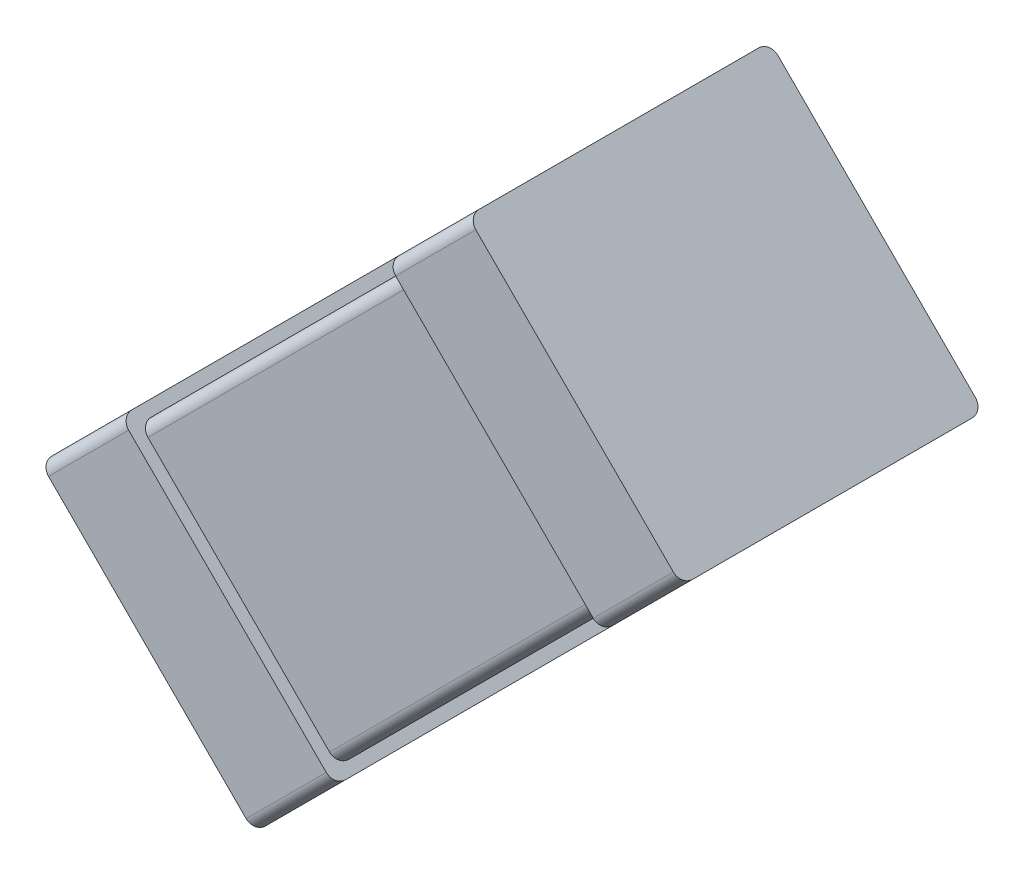
ISO-10303-21;
HEADER;
FILE_DESCRIPTION(('STEP AP214'),'2;1');
FILE_NAME('part.step','',(''),(''),'','','');
FILE_SCHEMA(('AUTOMOTIVE_DESIGN { 1 0 10303 214 1 1 1 1 }'));
ENDSEC;
DATA;
#1=APPLICATION_CONTEXT('core data for automotive mechanical design processes');
#2=APPLICATION_PROTOCOL_DEFINITION('international standard','automotive_design',2000,#1);
#3=PRODUCT_CONTEXT('',#1,'mechanical');
#4=PRODUCT('Part','Part','',(#3));
#5=PRODUCT_RELATED_PRODUCT_CATEGORY('part','',(#4));
#6=PRODUCT_DEFINITION_FORMATION('','',#4);
#7=PRODUCT_DEFINITION_CONTEXT('part definition',#1,'design');
#8=PRODUCT_DEFINITION('design','',#6,#7);
#9=PRODUCT_DEFINITION_SHAPE('','',#8);
#10=(LENGTH_UNIT() NAMED_UNIT(*) SI_UNIT(.MILLI.,.METRE.));
#11=(NAMED_UNIT(*) PLANE_ANGLE_UNIT() SI_UNIT($,.RADIAN.));
#12=(NAMED_UNIT(*) SI_UNIT($,.STERADIAN.) SOLID_ANGLE_UNIT());
#13=UNCERTAINTY_MEASURE_WITH_UNIT(LENGTH_MEASURE(1.E-05),#10,'distance_accuracy_value','');
#14=(GEOMETRIC_REPRESENTATION_CONTEXT(3) GLOBAL_UNCERTAINTY_ASSIGNED_CONTEXT((#13)) GLOBAL_UNIT_ASSIGNED_CONTEXT((#10,
#11,#12)) REPRESENTATION_CONTEXT('',''));
#15=CARTESIAN_POINT('',(0.,0.,0.));
#16=DIRECTION('',(0.,0.,1.));
#17=DIRECTION('',(1.,0.,0.));
#18=AXIS2_PLACEMENT_3D('',#15,#16,#17);
#19=CARTESIAN_POINT('',(165.881216142514,96.0422005798756,112.211582908599));
#20=DIRECTION('',(-0.707106781186547,-0.707106781186548,0.));
#21=DIRECTION('',(-0.707106781186548,0.707106781186547,0.));
#22=AXIS2_PLACEMENT_3D('',#19,#20,#21);
#23=PLANE('',#22);
#24=DIRECTION('',(0.,0.,1.));
#25=VECTOR('',#24,1.);
#26=CARTESIAN_POINT('',(165.881216142514,96.0422005798756,112.211582908599));
#27=LINE('',#26,#25);
#28=CARTESIAN_POINT('',(165.881216142514,96.0422005798756,112.241582908599));
#29=VERTEX_POINT('',#28);
#30=CARTESIAN_POINT('',(165.881216142514,96.0422005798756,112.981582908599));
#31=VERTEX_POINT('',#30);
#32=EDGE_CURVE('E67',#29,#31,#27,.T.);
#33=ORIENTED_EDGE('',*,*,#32,.F.);
#34=CARTESIAN_POINT('',(165.902429345949,96.02098737644,112.241582908599));
#35=DIRECTION('',(-0.707106781186547,-0.707106781186548,0.));
#36=DIRECTION('',(0.,0.,1.));
#37=AXIS2_PLACEMENT_3D('',#34,#35,#36);
#38=CIRCLE('',#37,0.0300000000000023);
#39=CARTESIAN_POINT('',(165.902429345949,96.02098737644,112.211582908599));
#40=VERTEX_POINT('',#39);
#41=EDGE_CURVE('E11',#29,#40,#38,.T.);
#42=ORIENTED_EDGE('',*,*,#41,.T.);
#43=DIRECTION('',(0.707106781186548,-0.707106781186547,0.));
#44=VECTOR('',#43,1.);
#45=CARTESIAN_POINT('',(165.881216142514,96.0422005798756,112.211582908599));
#46=LINE('',#45,#44);
#47=CARTESIAN_POINT('',(166.425688364028,95.4977283583619,112.211582908599));
#48=VERTEX_POINT('',#47);
#49=EDGE_CURVE('E55',#40,#48,#46,.T.);
#50=ORIENTED_EDGE('',*,*,#49,.T.);
#51=CARTESIAN_POINT('',(166.425688364028,95.4977283583619,112.241582908599));
#52=DIRECTION('',(0.707106781186547,0.707106781186548,0.));
#53=DIRECTION('',(0.,0.,1.));
#54=AXIS2_PLACEMENT_3D('',#51,#52,#53);
#55=CIRCLE('',#54,0.0300000000000023);
#56=CARTESIAN_POINT('',(166.446901567463,95.4765151549263,112.241582908599));
#57=VERTEX_POINT('',#56);
#58=EDGE_CURVE('E393',#57,#48,#55,.T.);
#59=ORIENTED_EDGE('',*,*,#58,.F.);
#60=DIRECTION('',(0.,0.,1.));
#61=VECTOR('',#60,1.);
#62=CARTESIAN_POINT('',(166.446901567463,95.4765151549263,112.211582908599));
#63=LINE('',#62,#61);
#64=CARTESIAN_POINT('',(166.446901567463,95.4765151549263,112.981582908599));
#65=VERTEX_POINT('',#64);
#66=EDGE_CURVE('E379',#57,#65,#63,.T.);
#67=ORIENTED_EDGE('',*,*,#66,.T.);
#68=CARTESIAN_POINT('',(166.425688364028,95.4977283583619,112.981582908599));
#69=DIRECTION('',(-0.707106781186547,-0.707106781186548,0.));
#70=DIRECTION('',(0.,0.,1.));
#71=AXIS2_PLACEMENT_3D('',#68,#69,#70);
#72=CIRCLE('',#71,0.0300000000000023);
#73=CARTESIAN_POINT('',(166.425688364028,95.4977283583619,113.011582908599));
#74=VERTEX_POINT('',#73);
#75=EDGE_CURVE('E48',#65,#74,#72,.T.);
#76=ORIENTED_EDGE('',*,*,#75,.T.);
#77=DIRECTION('',(0.707106781186548,-0.707106781186547,0.));
#78=VECTOR('',#77,1.);
#79=CARTESIAN_POINT('',(165.881216142514,96.0422005798756,113.011582908599));
#80=LINE('',#79,#78);
#81=CARTESIAN_POINT('',(165.902429345949,96.02098737644,113.011582908599));
#82=VERTEX_POINT('',#81);
#83=EDGE_CURVE('E431',#82,#74,#80,.T.);
#84=ORIENTED_EDGE('',*,*,#83,.F.);
#85=CARTESIAN_POINT('',(165.902429345949,96.02098737644,112.981582908599));
#86=DIRECTION('',(0.707106781186547,0.707106781186548,0.));
#87=DIRECTION('',(0.,0.,1.));
#88=AXIS2_PLACEMENT_3D('',#85,#86,#87);
#89=CIRCLE('',#88,0.0300000000000023);
#90=EDGE_CURVE('E474',#31,#82,#89,.T.);
#91=ORIENTED_EDGE('',*,*,#90,.F.);
#92=EDGE_LOOP('',(#33,#42,#50,#59,#67,#76,#84,#91));
#93=FACE_BOUND('',#92,.T.);
#94=ADVANCED_FACE('F44',(#93),#23,.T.);
#95=CARTESIAN_POINT('',(166.659033601819,95.6886471892823,112.211582908599));
#96=DIRECTION('',(0.707106781186548,-0.707106781186547,0.));
#97=DIRECTION('',(0.,0.,-1.));
#98=AXIS2_PLACEMENT_3D('',#95,#96,#97);
#99=PLANE('',#98);
#100=ORIENTED_EDGE('',*,*,#66,.F.);
#101=DIRECTION('',(-0.707106781186547,-0.707106781186548,0.));
#102=VECTOR('',#101,1.);
#103=CARTESIAN_POINT('',(166.659033601819,95.6886471892823,112.241582908599));
#104=LINE('',#103,#102);
#105=CARTESIAN_POINT('',(166.659033601819,95.6886471892823,112.241582908599));
#106=VERTEX_POINT('',#105);
#107=EDGE_CURVE('E397',#106,#57,#104,.T.);
#108=ORIENTED_EDGE('',*,*,#107,.F.);
#109=DIRECTION('',(0.,0.,1.));
#110=VECTOR('',#109,1.);
#111=CARTESIAN_POINT('',(166.659033601819,95.6886471892823,112.211582908599));
#112=LINE('',#111,#110);
#113=CARTESIAN_POINT('',(166.659033601819,95.6886471892823,112.981582908599));
#114=VERTEX_POINT('',#113);
#115=EDGE_CURVE('E468',#106,#114,#112,.T.);
#116=ORIENTED_EDGE('',*,*,#115,.T.);
#117=DIRECTION('',(-0.707106781186547,-0.707106781186548,0.));
#118=VECTOR('',#117,1.);
#119=CARTESIAN_POINT('',(166.659033601819,95.6886471892823,112.981582908599));
#120=LINE('',#119,#118);
#121=EDGE_CURVE('E452',#114,#65,#120,.T.);
#122=ORIENTED_EDGE('',*,*,#121,.T.);
#123=EDGE_LOOP('',(#100,#108,#116,#122));
#124=FACE_BOUND('',#123,.T.);
#125=ADVANCED_FACE('F608',(#124),#99,.T.);
#126=CARTESIAN_POINT('',(166.637820398384,95.7098603927179,112.981582908599));
#127=DIRECTION('',(-0.707106781186548,-0.707106781186548,0.));
#128=DIRECTION('',(0.707106781186548,-0.707106781186548,0.));
#129=AXIS2_PLACEMENT_3D('',#126,#127,#128);
#130=CYLINDRICAL_SURFACE('',#129,0.0299999999999963);
#131=CARTESIAN_POINT('',(166.637820398384,95.7098603927179,112.981582908599));
#132=DIRECTION('',(-0.707106781186547,-0.707106781186548,0.));
#133=DIRECTION('',(0.,0.,1.));
#134=AXIS2_PLACEMENT_3D('',#131,#132,#133);
#135=CIRCLE('',#134,0.0300000000000023);
#136=CARTESIAN_POINT('',(166.637820398384,95.7098603927179,113.011582908599));
#137=VERTEX_POINT('',#136);
#138=EDGE_CURVE('E448',#114,#137,#135,.T.);
#139=ORIENTED_EDGE('',*,*,#138,.T.);
#140=DIRECTION('',(-0.707106781186547,-0.707106781186548,0.));
#141=VECTOR('',#140,1.);
#142=CARTESIAN_POINT('',(166.637820398384,95.7098603927179,113.011582908599));
#143=LINE('',#142,#141);
#144=EDGE_CURVE('E453',#137,#74,#143,.T.);
#145=ORIENTED_EDGE('',*,*,#144,.T.);
#146=ORIENTED_EDGE('',*,*,#75,.F.);
#147=ORIENTED_EDGE('',*,*,#121,.F.);
#148=EDGE_LOOP('',(#139,#145,#146,#147));
#149=FACE_BOUND('',#148,.T.);
#150=ADVANCED_FACE('F613',(#149),#130,.T.);
#151=CARTESIAN_POINT('',(166.637820398384,95.7098603927179,112.241582908599));
#152=DIRECTION('',(-0.707106781186548,-0.707106781186548,0.));
#153=DIRECTION('',(0.707106781186548,-0.707106781186548,0.));
#154=AXIS2_PLACEMENT_3D('',#151,#152,#153);
#155=CYLINDRICAL_SURFACE('',#154,0.0299999999999963);
#156=ORIENTED_EDGE('',*,*,#107,.T.);
#157=ORIENTED_EDGE('',*,*,#58,.T.);
#158=DIRECTION('',(-0.707106781186547,-0.707106781186548,0.));
#159=VECTOR('',#158,1.);
#160=CARTESIAN_POINT('',(166.637820398384,95.7098603927179,112.211582908599));
#161=LINE('',#160,#159);
#162=CARTESIAN_POINT('',(166.637820398384,95.7098603927179,112.211582908599));
#163=VERTEX_POINT('',#162);
#164=EDGE_CURVE('E496',#163,#48,#161,.T.);
#165=ORIENTED_EDGE('',*,*,#164,.F.);
#166=CARTESIAN_POINT('',(166.637820398384,95.7098603927179,112.241582908599));
#167=DIRECTION('',(0.707106781186547,0.707106781186548,0.));
#168=DIRECTION('',(0.,0.,1.));
#169=AXIS2_PLACEMENT_3D('',#166,#167,#168);
#170=CIRCLE('',#169,0.0300000000000023);
#171=EDGE_CURVE('E320',#106,#163,#170,.T.);
#172=ORIENTED_EDGE('',*,*,#171,.F.);
#173=EDGE_LOOP('',(#156,#157,#165,#172));
#174=FACE_BOUND('',#173,.T.);
#175=ADVANCED_FACE('F627',(#174),#155,.T.);
#176=CARTESIAN_POINT('',(166.09334817687,96.2543326142315,113.011582908599));
#177=DIRECTION('',(0.,0.,1.));
#178=DIRECTION('',(1.,0.,0.));
#179=AXIS2_PLACEMENT_3D('',#176,#177,#178);
#180=PLANE('',#179);
#181=DIRECTION('',(0.707106781186548,-0.707106781186547,0.));
#182=VECTOR('',#181,1.);
#183=CARTESIAN_POINT('',(166.09334817687,96.2543326142315,113.011582908599));
#184=LINE('',#183,#182);
#185=CARTESIAN_POINT('',(166.114561380306,96.2331194107959,113.011582908599));
#186=VERTEX_POINT('',#185);
#187=EDGE_CURVE('E315',#186,#137,#184,.T.);
#188=ORIENTED_EDGE('',*,*,#187,.F.);
#189=DIRECTION('',(-0.707106781186547,-0.707106781186548,0.));
#190=VECTOR('',#189,1.);
#191=CARTESIAN_POINT('',(166.114561380306,96.2331194107959,113.011582908599));
#192=LINE('',#191,#190);
#193=EDGE_CURVE('E398',#186,#82,#192,.T.);
#194=ORIENTED_EDGE('',*,*,#193,.T.);
#195=ORIENTED_EDGE('',*,*,#83,.T.);
#196=ORIENTED_EDGE('',*,*,#144,.F.);
#197=EDGE_LOOP('',(#188,#194,#195,#196));
#198=FACE_BOUND('',#197,.T.);
#199=ADVANCED_FACE('F620',(#198),#180,.T.);
#200=CARTESIAN_POINT('',(166.09334817687,96.2543326142315,112.211582908599));
#201=DIRECTION('',(0.,0.,1.));
#202=DIRECTION('',(1.,0.,0.));
#203=AXIS2_PLACEMENT_3D('',#200,#201,#202);
#204=PLANE('',#203);
#205=ORIENTED_EDGE('',*,*,#164,.T.);
#206=ORIENTED_EDGE('',*,*,#49,.F.);
#207=DIRECTION('',(-0.707106781186547,-0.707106781186548,0.));
#208=VECTOR('',#207,1.);
#209=CARTESIAN_POINT('',(166.114561380306,96.2331194107959,112.211582908599));
#210=LINE('',#209,#208);
#211=CARTESIAN_POINT('',(166.114561380306,96.2331194107959,112.211582908599));
#212=VERTEX_POINT('',#211);
#213=EDGE_CURVE('E419',#212,#40,#210,.T.);
#214=ORIENTED_EDGE('',*,*,#213,.F.);
#215=DIRECTION('',(0.707106781186548,-0.707106781186547,0.));
#216=VECTOR('',#215,1.);
#217=CARTESIAN_POINT('',(166.09334817687,96.2543326142315,112.211582908599));
#218=LINE('',#217,#216);
#219=EDGE_CURVE('E544',#212,#163,#218,.T.);
#220=ORIENTED_EDGE('',*,*,#219,.T.);
#221=EDGE_LOOP('',(#205,#206,#214,#220));
#222=FACE_BOUND('',#221,.T.);
#223=ADVANCED_FACE('F617',(#222),#204,.F.);
#224=CARTESIAN_POINT('',(166.114561380306,96.2331194107959,112.981582908599));
#225=DIRECTION('',(-0.707106781186548,-0.707106781186548,0.));
#226=DIRECTION('',(-0.707106781186548,0.707106781186548,0.));
#227=AXIS2_PLACEMENT_3D('',#224,#225,#226);
#228=CYLINDRICAL_SURFACE('',#227,0.0299999999999963);
#229=DIRECTION('',(-0.707106781186547,-0.707106781186548,0.));
#230=VECTOR('',#229,1.);
#231=CARTESIAN_POINT('',(166.09334817687,96.2543326142315,112.981582908599));
#232=LINE('',#231,#230);
#233=CARTESIAN_POINT('',(166.09334817687,96.2543326142315,112.981582908599));
#234=VERTEX_POINT('',#233);
#235=EDGE_CURVE('E309',#234,#31,#232,.T.);
#236=ORIENTED_EDGE('',*,*,#235,.T.);
#237=ORIENTED_EDGE('',*,*,#90,.T.);
#238=ORIENTED_EDGE('',*,*,#193,.F.);
#239=CARTESIAN_POINT('',(166.114561380306,96.2331194107959,112.981582908599));
#240=DIRECTION('',(0.707106781186547,0.707106781186548,0.));
#241=DIRECTION('',(0.,0.,1.));
#242=AXIS2_PLACEMENT_3D('',#239,#240,#241);
#243=CIRCLE('',#242,0.0300000000000023);
#244=EDGE_CURVE('E319',#234,#186,#243,.T.);
#245=ORIENTED_EDGE('',*,*,#244,.F.);
#246=EDGE_LOOP('',(#236,#237,#238,#245));
#247=FACE_BOUND('',#246,.T.);
#248=ADVANCED_FACE('F557',(#247),#228,.T.);
#249=CARTESIAN_POINT('',(166.114561380306,96.2331194107959,112.241582908599));
#250=DIRECTION('',(-0.707106781186548,-0.707106781186548,0.));
#251=DIRECTION('',(-0.707106781186548,0.707106781186548,0.));
#252=AXIS2_PLACEMENT_3D('',#249,#250,#251);
#253=CYLINDRICAL_SURFACE('',#252,0.0299999999999963);
#254=CARTESIAN_POINT('',(166.114561380306,96.2331194107959,112.241582908599));
#255=DIRECTION('',(-0.707106781186547,-0.707106781186548,0.));
#256=DIRECTION('',(0.,0.,1.));
#257=AXIS2_PLACEMENT_3D('',#254,#255,#256);
#258=CIRCLE('',#257,0.0300000000000023);
#259=CARTESIAN_POINT('',(166.09334817687,96.2543326142315,112.241582908599));
#260=VERTEX_POINT('',#259);
#261=EDGE_CURVE('E423',#260,#212,#258,.T.);
#262=ORIENTED_EDGE('',*,*,#261,.T.);
#263=ORIENTED_EDGE('',*,*,#213,.T.);
#264=ORIENTED_EDGE('',*,*,#41,.F.);
#265=DIRECTION('',(-0.707106781186547,-0.707106781186548,0.));
#266=VECTOR('',#265,1.);
#267=CARTESIAN_POINT('',(166.09334817687,96.2543326142315,112.241582908599));
#268=LINE('',#267,#266);
#269=EDGE_CURVE('E424',#260,#29,#268,.T.);
#270=ORIENTED_EDGE('',*,*,#269,.F.);
#271=EDGE_LOOP('',(#262,#263,#264,#270));
#272=FACE_BOUND('',#271,.T.);
#273=ADVANCED_FACE('F623',(#272),#253,.T.);
#274=CARTESIAN_POINT('',(166.09334817687,96.2543326142315,112.211582908599));
#275=DIRECTION('',(0.707106781186548,-0.707106781186547,0.));
#276=DIRECTION('',(0.,0.,-1.));
#277=AXIS2_PLACEMENT_3D('',#274,#275,#276);
#278=PLANE('',#277);
#279=ORIENTED_EDGE('',*,*,#235,.F.);
#280=DIRECTION('',(0.,0.,1.));
#281=VECTOR('',#280,1.);
#282=CARTESIAN_POINT('',(166.09334817687,96.2543326142315,112.211582908599));
#283=LINE('',#282,#281);
#284=EDGE_CURVE('E351',#260,#234,#283,.T.);
#285=ORIENTED_EDGE('',*,*,#284,.F.);
#286=ORIENTED_EDGE('',*,*,#269,.T.);
#287=ORIENTED_EDGE('',*,*,#32,.T.);
#288=EDGE_LOOP('',(#279,#285,#286,#287));
#289=FACE_BOUND('',#288,.T.);
#290=ADVANCED_FACE('F559',(#289),#278,.F.);
#291=CARTESIAN_POINT('',(166.09334817687,96.2543326142315,112.211582908599));
#292=DIRECTION('',(-0.707106781186547,-0.707106781186548,0.));
#293=DIRECTION('',(-0.707106781186548,0.707106781186547,0.));
#294=AXIS2_PLACEMENT_3D('',#291,#292,#293);
#295=PLANE('',#294);
#296=ORIENTED_EDGE('',*,*,#244,.T.);
#297=ORIENTED_EDGE('',*,*,#187,.T.);
#298=ORIENTED_EDGE('',*,*,#138,.F.);
#299=ORIENTED_EDGE('',*,*,#115,.F.);
#300=ORIENTED_EDGE('',*,*,#171,.T.);
#301=ORIENTED_EDGE('',*,*,#219,.F.);
#302=ORIENTED_EDGE('',*,*,#261,.F.);
#303=ORIENTED_EDGE('',*,*,#284,.T.);
#304=EDGE_LOOP('',(#296,#297,#298,#299,#300,#301,#302,#303));
#305=FACE_BOUND('',#304,.T.);
#306=DIRECTION('',(0.707106781186548,-0.707106781186547,0.));
#307=VECTOR('',#306,1.);
#308=CARTESIAN_POINT('',(166.114561380306,96.2331194107959,112.241582908599));
#309=LINE('',#308,#307);
#310=CARTESIAN_POINT('',(166.135774583742,96.2119062073604,112.241582908599));
#311=VERTEX_POINT('',#310);
#312=CARTESIAN_POINT('',(166.616607194948,95.7310735961535,112.241582908599));
#313=VERTEX_POINT('',#312);
#314=EDGE_CURVE('E334',#311,#313,#309,.T.);
#315=ORIENTED_EDGE('',*,*,#314,.T.);
#316=CARTESIAN_POINT('',(166.616607194948,95.7310735961535,112.271582908599));
#317=DIRECTION('',(0.707106781186547,0.707106781186548,0.));
#318=DIRECTION('',(0.,0.,1.));
#319=AXIS2_PLACEMENT_3D('',#316,#317,#318);
#320=CIRCLE('',#319,0.0300000000000023);
#321=CARTESIAN_POINT('',(166.637820398384,95.7098603927179,112.271582908599));
#322=VERTEX_POINT('',#321);
#323=EDGE_CURVE('E411',#322,#313,#320,.T.);
#324=ORIENTED_EDGE('',*,*,#323,.F.);
#325=DIRECTION('',(0.,0.,1.));
#326=VECTOR('',#325,1.);
#327=CARTESIAN_POINT('',(166.637820398384,95.7098603927179,112.241582908599));
#328=LINE('',#327,#326);
#329=CARTESIAN_POINT('',(166.637820398384,95.7098603927179,112.951582908599));
#330=VERTEX_POINT('',#329);
#331=EDGE_CURVE('E330',#322,#330,#328,.T.);
#332=ORIENTED_EDGE('',*,*,#331,.T.);
#333=CARTESIAN_POINT('',(166.616607194948,95.7310735961535,112.951582908599));
#334=DIRECTION('',(-0.707106781186547,-0.707106781186548,0.));
#335=DIRECTION('',(0.,0.,1.));
#336=AXIS2_PLACEMENT_3D('',#333,#334,#335);
#337=CIRCLE('',#336,0.0300000000000023);
#338=CARTESIAN_POINT('',(166.616607194948,95.7310735961535,112.981582908599));
#339=VERTEX_POINT('',#338);
#340=EDGE_CURVE('E335',#330,#339,#337,.T.);
#341=ORIENTED_EDGE('',*,*,#340,.T.);
#342=DIRECTION('',(0.707106781186548,-0.707106781186547,0.));
#343=VECTOR('',#342,1.);
#344=CARTESIAN_POINT('',(166.114561380306,96.2331194107959,112.981582908599));
#345=LINE('',#344,#343);
#346=CARTESIAN_POINT('',(166.135774583742,96.2119062073604,112.981582908599));
#347=VERTEX_POINT('',#346);
#348=EDGE_CURVE('E132',#347,#339,#345,.T.);
#349=ORIENTED_EDGE('',*,*,#348,.F.);
#350=CARTESIAN_POINT('',(166.135774583742,96.2119062073604,112.951582908599));
#351=DIRECTION('',(0.707106781186547,0.707106781186548,0.));
#352=DIRECTION('',(0.,0.,1.));
#353=AXIS2_PLACEMENT_3D('',#350,#351,#352);
#354=CIRCLE('',#353,0.0300000000000023);
#355=CARTESIAN_POINT('',(166.114561380306,96.2331194107959,112.951582908599));
#356=VERTEX_POINT('',#355);
#357=EDGE_CURVE('E402',#356,#347,#354,.T.);
#358=ORIENTED_EDGE('',*,*,#357,.F.);
#359=DIRECTION('',(0.,0.,1.));
#360=VECTOR('',#359,1.);
#361=CARTESIAN_POINT('',(166.114561380306,96.2331194107959,112.241582908599));
#362=LINE('',#361,#360);
#363=CARTESIAN_POINT('',(166.114561380306,96.2331194107959,112.271582908599));
#364=VERTEX_POINT('',#363);
#365=EDGE_CURVE('E288',#364,#356,#362,.T.);
#366=ORIENTED_EDGE('',*,*,#365,.F.);
#367=CARTESIAN_POINT('',(166.135774583742,96.2119062073604,112.271582908599));
#368=DIRECTION('',(-0.707106781186547,-0.707106781186548,0.));
#369=DIRECTION('',(0.,0.,1.));
#370=AXIS2_PLACEMENT_3D('',#367,#368,#369);
#371=CIRCLE('',#370,0.0300000000000023);
#372=EDGE_CURVE('E286',#364,#311,#371,.T.);
#373=ORIENTED_EDGE('',*,*,#372,.T.);
#374=EDGE_LOOP('',(#315,#324,#332,#341,#349,#358,#366,#373));
#375=FACE_BOUND('',#374,.T.);
#376=ADVANCED_FACE('F549',(#305,#375),#295,.F.);
#377=CARTESIAN_POINT('',(166.821668161492,96.9402261919825,112.241582908599));
#378=DIRECTION('',(0.707106781186548,-0.707106781186547,0.));
#379=DIRECTION('',(0.,0.,-1.));
#380=AXIS2_PLACEMENT_3D('',#377,#378,#379);
#381=PLANE('',#380);
#382=DIRECTION('',(-0.707106781186547,-0.707106781186548,0.));
#383=VECTOR('',#382,1.);
#384=CARTESIAN_POINT('',(166.821668161492,96.9402261919825,112.951582908599));
#385=LINE('',#384,#383);
#386=CARTESIAN_POINT('',(166.821668161492,96.9402261919825,112.951582908599));
#387=VERTEX_POINT('',#386);
#388=EDGE_CURVE('E274',#387,#356,#385,.T.);
#389=ORIENTED_EDGE('',*,*,#388,.F.);
#390=DIRECTION('',(0.,0.,1.));
#391=VECTOR('',#390,1.);
#392=CARTESIAN_POINT('',(166.821668161492,96.9402261919825,112.241582908599));
#393=LINE('',#392,#391);
#394=CARTESIAN_POINT('',(166.821668161492,96.9402261919825,112.271582908599));
#395=VERTEX_POINT('',#394);
#396=EDGE_CURVE('E263',#395,#387,#393,.T.);
#397=ORIENTED_EDGE('',*,*,#396,.F.);
#398=DIRECTION('',(-0.707106781186547,-0.707106781186548,0.));
#399=VECTOR('',#398,1.);
#400=CARTESIAN_POINT('',(166.821668161492,96.9402261919825,112.271582908599));
#401=LINE('',#400,#399);
#402=EDGE_CURVE('E272',#395,#364,#401,.T.);
#403=ORIENTED_EDGE('',*,*,#402,.T.);
#404=ORIENTED_EDGE('',*,*,#365,.T.);
#405=EDGE_LOOP('',(#389,#397,#403,#404));
#406=FACE_BOUND('',#405,.T.);
#407=ADVANCED_FACE('F270',(#406),#381,.F.);
#408=CARTESIAN_POINT('',(166.842881364928,96.9190129885469,112.951582908599));
#409=DIRECTION('',(-0.707106781186548,-0.707106781186548,0.));
#410=DIRECTION('',(-0.707106781186548,0.707106781186548,0.));
#411=AXIS2_PLACEMENT_3D('',#408,#409,#410);
#412=CYLINDRICAL_SURFACE('',#411,0.0299999999999963);
#413=ORIENTED_EDGE('',*,*,#388,.T.);
#414=ORIENTED_EDGE('',*,*,#357,.T.);
#415=DIRECTION('',(-0.707106781186547,-0.707106781186548,0.));
#416=VECTOR('',#415,1.);
#417=CARTESIAN_POINT('',(166.842881364928,96.9190129885469,112.981582908599));
#418=LINE('',#417,#416);
#419=CARTESIAN_POINT('',(166.842881364928,96.9190129885469,112.981582908599));
#420=VERTEX_POINT('',#419);
#421=EDGE_CURVE('E405',#420,#347,#418,.T.);
#422=ORIENTED_EDGE('',*,*,#421,.F.);
#423=CARTESIAN_POINT('',(166.842881364928,96.9190129885469,112.951582908599));
#424=DIRECTION('',(0.707106781186547,0.707106781186548,0.));
#425=DIRECTION('',(0.,0.,1.));
#426=AXIS2_PLACEMENT_3D('',#423,#424,#425);
#427=CIRCLE('',#426,0.0300000000000023);
#428=EDGE_CURVE('E278',#387,#420,#427,.T.);
#429=ORIENTED_EDGE('',*,*,#428,.F.);
#430=EDGE_LOOP('',(#413,#414,#422,#429));
#431=FACE_BOUND('',#430,.T.);
#432=ADVANCED_FACE('F577',(#431),#412,.T.);
#433=CARTESIAN_POINT('',(166.821668161492,96.9402261919825,112.981582908599));
#434=DIRECTION('',(0.,0.,1.));
#435=DIRECTION('',(1.,0.,0.));
#436=AXIS2_PLACEMENT_3D('',#433,#434,#435);
#437=PLANE('',#436);
#438=DIRECTION('',(0.707106781186548,-0.707106781186547,0.));
#439=VECTOR('',#438,1.);
#440=CARTESIAN_POINT('',(166.821668161492,96.9402261919825,112.981582908599));
#441=LINE('',#440,#439);
#442=CARTESIAN_POINT('',(167.323713976134,96.43818037734,112.981582908599));
#443=VERTEX_POINT('',#442);
#444=EDGE_CURVE('E389',#420,#443,#441,.T.);
#445=ORIENTED_EDGE('',*,*,#444,.F.);
#446=ORIENTED_EDGE('',*,*,#421,.T.);
#447=ORIENTED_EDGE('',*,*,#348,.T.);
#448=DIRECTION('',(-0.707106781186547,-0.707106781186548,0.));
#449=VECTOR('',#448,1.);
#450=CARTESIAN_POINT('',(167.323713976134,96.43818037734,112.981582908599));
#451=LINE('',#450,#449);
#452=EDGE_CURVE('E434',#443,#339,#451,.T.);
#453=ORIENTED_EDGE('',*,*,#452,.F.);
#454=EDGE_LOOP('',(#445,#446,#447,#453));
#455=FACE_BOUND('',#454,.T.);
#456=ADVANCED_FACE('F575',(#455),#437,.T.);
#457=CARTESIAN_POINT('',(167.323713976134,96.43818037734,112.951582908599));
#458=DIRECTION('',(-0.707106781186548,-0.707106781186548,0.));
#459=DIRECTION('',(0.707106781186548,-0.707106781186548,0.));
#460=AXIS2_PLACEMENT_3D('',#457,#458,#459);
#461=CYLINDRICAL_SURFACE('',#460,0.0299999999999963);
#462=CARTESIAN_POINT('',(167.323713976134,96.43818037734,112.951582908599));
#463=DIRECTION('',(-0.707106781186547,-0.707106781186548,0.));
#464=DIRECTION('',(0.,0.,1.));
#465=AXIS2_PLACEMENT_3D('',#462,#463,#464);
#466=CIRCLE('',#465,0.0300000000000023);
#467=CARTESIAN_POINT('',(167.344927179571,96.4169671739044,112.951582908599));
#468=VERTEX_POINT('',#467);
#469=EDGE_CURVE('E438',#468,#443,#466,.T.);
#470=ORIENTED_EDGE('',*,*,#469,.T.);
#471=ORIENTED_EDGE('',*,*,#452,.T.);
#472=ORIENTED_EDGE('',*,*,#340,.F.);
#473=DIRECTION('',(-0.707106781186547,-0.707106781186548,0.));
#474=VECTOR('',#473,1.);
#475=CARTESIAN_POINT('',(167.344927179571,96.4169671739044,112.951582908599));
#476=LINE('',#475,#474);
#477=EDGE_CURVE('E410',#468,#330,#476,.T.);
#478=ORIENTED_EDGE('',*,*,#477,.F.);
#479=EDGE_LOOP('',(#470,#471,#472,#478));
#480=FACE_BOUND('',#479,.T.);
#481=ADVANCED_FACE('F590',(#480),#461,.T.);
#482=CARTESIAN_POINT('',(167.344927179571,96.4169671739044,112.241582908599));
#483=DIRECTION('',(0.707106781186548,-0.707106781186547,0.));
#484=DIRECTION('',(0.,0.,-1.));
#485=AXIS2_PLACEMENT_3D('',#482,#483,#484);
#486=PLANE('',#485);
#487=ORIENTED_EDGE('',*,*,#331,.F.);
#488=DIRECTION('',(-0.707106781186547,-0.707106781186548,0.));
#489=VECTOR('',#488,1.);
#490=CARTESIAN_POINT('',(167.344927179571,96.4169671739044,112.271582908599));
#491=LINE('',#490,#489);
#492=CARTESIAN_POINT('',(167.344927179571,96.4169671739044,112.271582908599));
#493=VERTEX_POINT('',#492);
#494=EDGE_CURVE('E406',#493,#322,#491,.T.);
#495=ORIENTED_EDGE('',*,*,#494,.F.);
#496=DIRECTION('',(0.,0.,1.));
#497=VECTOR('',#496,1.);
#498=CARTESIAN_POINT('',(167.344927179571,96.4169671739044,112.241582908599));
#499=LINE('',#498,#497);
#500=EDGE_CURVE('E439',#493,#468,#499,.T.);
#501=ORIENTED_EDGE('',*,*,#500,.T.);
#502=ORIENTED_EDGE('',*,*,#477,.T.);
#503=EDGE_LOOP('',(#487,#495,#501,#502));
#504=FACE_BOUND('',#503,.T.);
#505=ADVANCED_FACE('F586',(#504),#486,.T.);
#506=CARTESIAN_POINT('',(167.323713976134,96.43818037734,112.271582908599));
#507=DIRECTION('',(-0.707106781186548,-0.707106781186548,0.));
#508=DIRECTION('',(0.707106781186548,-0.707106781186548,0.));
#509=AXIS2_PLACEMENT_3D('',#506,#507,#508);
#510=CYLINDRICAL_SURFACE('',#509,0.0299999999999963);
#511=ORIENTED_EDGE('',*,*,#494,.T.);
#512=ORIENTED_EDGE('',*,*,#323,.T.);
#513=DIRECTION('',(-0.707106781186547,-0.707106781186548,0.));
#514=VECTOR('',#513,1.);
#515=CARTESIAN_POINT('',(167.323713976134,96.43818037734,112.241582908599));
#516=LINE('',#515,#514);
#517=CARTESIAN_POINT('',(167.323713976134,96.43818037734,112.241582908599));
#518=VERTEX_POINT('',#517);
#519=EDGE_CURVE('E302',#518,#313,#516,.T.);
#520=ORIENTED_EDGE('',*,*,#519,.F.);
#521=CARTESIAN_POINT('',(167.323713976134,96.43818037734,112.271582908599));
#522=DIRECTION('',(0.707106781186547,0.707106781186548,0.));
#523=DIRECTION('',(0.,0.,1.));
#524=AXIS2_PLACEMENT_3D('',#521,#522,#523);
#525=CIRCLE('',#524,0.0300000000000023);
#526=EDGE_CURVE('E328',#493,#518,#525,.T.);
#527=ORIENTED_EDGE('',*,*,#526,.F.);
#528=EDGE_LOOP('',(#511,#512,#520,#527));
#529=FACE_BOUND('',#528,.T.);
#530=ADVANCED_FACE('F594',(#529),#510,.T.);
#531=CARTESIAN_POINT('',(166.821668161492,96.9402261919825,112.241582908599));
#532=DIRECTION('',(0.,0.,1.));
#533=DIRECTION('',(1.,0.,0.));
#534=AXIS2_PLACEMENT_3D('',#531,#532,#533);
#535=PLANE('',#534);
#536=ORIENTED_EDGE('',*,*,#519,.T.);
#537=ORIENTED_EDGE('',*,*,#314,.F.);
#538=DIRECTION('',(-0.707106781186547,-0.707106781186548,0.));
#539=VECTOR('',#538,1.);
#540=CARTESIAN_POINT('',(166.842881364928,96.9190129885469,112.241582908599));
#541=LINE('',#540,#539);
#542=CARTESIAN_POINT('',(166.842881364928,96.9190129885469,112.241582908599));
#543=VERTEX_POINT('',#542);
#544=EDGE_CURVE('E296',#543,#311,#541,.T.);
#545=ORIENTED_EDGE('',*,*,#544,.F.);
#546=DIRECTION('',(0.707106781186548,-0.707106781186547,0.));
#547=VECTOR('',#546,1.);
#548=CARTESIAN_POINT('',(166.821668161492,96.9402261919825,112.241582908599));
#549=LINE('',#548,#547);
#550=EDGE_CURVE('E294',#543,#518,#549,.T.);
#551=ORIENTED_EDGE('',*,*,#550,.T.);
#552=EDGE_LOOP('',(#536,#537,#545,#551));
#553=FACE_BOUND('',#552,.T.);
#554=ADVANCED_FACE('F46',(#553),#535,.F.);
#555=CARTESIAN_POINT('',(166.842881364928,96.9190129885469,112.271582908599));
#556=DIRECTION('',(-0.707106781186548,-0.707106781186548,0.));
#557=DIRECTION('',(-0.707106781186548,0.707106781186548,0.));
#558=AXIS2_PLACEMENT_3D('',#555,#556,#557);
#559=CYLINDRICAL_SURFACE('',#558,0.0299999999999963);
#560=CARTESIAN_POINT('',(166.842881364928,96.9190129885469,112.271582908599));
#561=DIRECTION('',(-0.707106781186547,-0.707106781186548,0.));
#562=DIRECTION('',(0.,0.,1.));
#563=AXIS2_PLACEMENT_3D('',#560,#561,#562);
#564=CIRCLE('',#563,0.0300000000000023);
#565=EDGE_CURVE('E285',#395,#543,#564,.T.);
#566=ORIENTED_EDGE('',*,*,#565,.T.);
#567=ORIENTED_EDGE('',*,*,#544,.T.);
#568=ORIENTED_EDGE('',*,*,#372,.F.);
#569=ORIENTED_EDGE('',*,*,#402,.F.);
#570=EDGE_LOOP('',(#566,#567,#568,#569));
#571=FACE_BOUND('',#570,.T.);
#572=ADVANCED_FACE('F283',(#571),#559,.T.);
#573=CARTESIAN_POINT('',(166.800454958057,96.9614393954181,112.211582908599));
#574=DIRECTION('',(-0.707106781186547,-0.707106781186548,0.));
#575=DIRECTION('',(-0.707106781186548,0.707106781186547,0.));
#576=AXIS2_PLACEMENT_3D('',#573,#574,#575);
#577=PLANE('',#576);
#578=DIRECTION('',(0.,0.,1.));
#579=VECTOR('',#578,1.);
#580=CARTESIAN_POINT('',(166.800454958057,96.9614393954181,112.211582908599));
#581=LINE('',#580,#579);
#582=CARTESIAN_POINT('',(166.800454958057,96.9614393954181,112.241582908599));
#583=VERTEX_POINT('',#582);
#584=CARTESIAN_POINT('',(166.800454958057,96.9614393954181,112.981582908599));
#585=VERTEX_POINT('',#584);
#586=EDGE_CURVE('E385',#583,#585,#581,.T.);
#587=ORIENTED_EDGE('',*,*,#586,.F.);
#588=CARTESIAN_POINT('',(166.821668161492,96.9402261919825,112.241582908599));
#589=DIRECTION('',(-0.707106781186547,-0.707106781186548,0.));
#590=DIRECTION('',(0.,0.,1.));
#591=AXIS2_PLACEMENT_3D('',#588,#589,#590);
#592=CIRCLE('',#591,0.0300000000000023);
#593=CARTESIAN_POINT('',(166.821668161492,96.9402261919825,112.211582908599));
#594=VERTEX_POINT('',#593);
#595=EDGE_CURVE('E305',#583,#594,#592,.T.);
#596=ORIENTED_EDGE('',*,*,#595,.T.);
#597=DIRECTION('',(0.707106781186548,-0.707106781186547,0.));
#598=VECTOR('',#597,1.);
#599=CARTESIAN_POINT('',(166.800454958057,96.9614393954181,112.211582908599));
#600=LINE('',#599,#598);
#601=CARTESIAN_POINT('',(167.344927179571,96.4169671739044,112.211582908599));
#602=VERTEX_POINT('',#601);
#603=EDGE_CURVE('E339',#594,#602,#600,.T.);
#604=ORIENTED_EDGE('',*,*,#603,.T.);
#605=CARTESIAN_POINT('',(167.344927179571,96.4169671739044,112.241582908599));
#606=DIRECTION('',(0.707106781186547,0.707106781186548,0.));
#607=DIRECTION('',(0.,0.,1.));
#608=AXIS2_PLACEMENT_3D('',#605,#606,#607);
#609=CIRCLE('',#608,0.0300000000000023);
#610=CARTESIAN_POINT('',(167.366140383006,96.3957539704688,112.241582908599));
#611=VERTEX_POINT('',#610);
#612=EDGE_CURVE('E352',#611,#602,#609,.T.);
#613=ORIENTED_EDGE('',*,*,#612,.F.);
#614=DIRECTION('',(0.,0.,1.));
#615=VECTOR('',#614,1.);
#616=CARTESIAN_POINT('',(167.366140383006,96.3957539704688,112.211582908599));
#617=LINE('',#616,#615);
#618=CARTESIAN_POINT('',(167.366140383006,96.3957539704688,112.981582908599));
#619=VERTEX_POINT('',#618);
#620=EDGE_CURVE('E343',#611,#619,#617,.T.);
#621=ORIENTED_EDGE('',*,*,#620,.T.);
#622=CARTESIAN_POINT('',(167.344927179571,96.4169671739044,112.981582908599));
#623=DIRECTION('',(-0.707106781186547,-0.707106781186548,0.));
#624=DIRECTION('',(0.,0.,1.));
#625=AXIS2_PLACEMENT_3D('',#622,#623,#624);
#626=CIRCLE('',#625,0.0300000000000023);
#627=CARTESIAN_POINT('',(167.344927179571,96.4169671739044,113.011582908599));
#628=VERTEX_POINT('',#627);
#629=EDGE_CURVE('E277',#619,#628,#626,.T.);
#630=ORIENTED_EDGE('',*,*,#629,.T.);
#631=DIRECTION('',(0.707106781186548,-0.707106781186547,0.));
#632=VECTOR('',#631,1.);
#633=CARTESIAN_POINT('',(166.800454958057,96.9614393954181,113.011582908599));
#634=LINE('',#633,#632);
#635=CARTESIAN_POINT('',(166.821668161492,96.9402261919825,113.011582908599));
#636=VERTEX_POINT('',#635);
#637=EDGE_CURVE('E374',#636,#628,#634,.T.);
#638=ORIENTED_EDGE('',*,*,#637,.F.);
#639=CARTESIAN_POINT('',(166.821668161492,96.9402261919825,112.981582908599));
#640=DIRECTION('',(0.707106781186547,0.707106781186548,0.));
#641=DIRECTION('',(0.,0.,1.));
#642=AXIS2_PLACEMENT_3D('',#639,#640,#641);
#643=CIRCLE('',#642,0.0300000000000023);
#644=EDGE_CURVE('E312',#585,#636,#643,.T.);
#645=ORIENTED_EDGE('',*,*,#644,.F.);
#646=EDGE_LOOP('',(#587,#596,#604,#613,#621,#630,#638,#645));
#647=FACE_BOUND('',#646,.T.);
#648=ORIENTED_EDGE('',*,*,#565,.F.);
#649=ORIENTED_EDGE('',*,*,#396,.T.);
#650=ORIENTED_EDGE('',*,*,#428,.T.);
#651=ORIENTED_EDGE('',*,*,#444,.T.);
#652=ORIENTED_EDGE('',*,*,#469,.F.);
#653=ORIENTED_EDGE('',*,*,#500,.F.);
#654=ORIENTED_EDGE('',*,*,#526,.T.);
#655=ORIENTED_EDGE('',*,*,#550,.F.);
#656=EDGE_LOOP('',(#648,#649,#650,#651,#652,#653,#654,#655));
#657=FACE_BOUND('',#656,.T.);
#658=ADVANCED_FACE('F291',(#647,#657),#577,.T.);
#659=CARTESIAN_POINT('',(167.578272417362,96.6078860048248,112.211582908599));
#660=DIRECTION('',(0.707106781186548,-0.707106781186547,0.));
#661=DIRECTION('',(0.,0.,-1.));
#662=AXIS2_PLACEMENT_3D('',#659,#660,#661);
#663=PLANE('',#662);
#664=ORIENTED_EDGE('',*,*,#620,.F.);
#665=DIRECTION('',(-0.707106781186547,-0.707106781186548,0.));
#666=VECTOR('',#665,1.);
#667=CARTESIAN_POINT('',(167.578272417362,96.6078860048248,112.241582908599));
#668=LINE('',#667,#666);
#669=CARTESIAN_POINT('',(167.578272417362,96.6078860048248,112.241582908599));
#670=VERTEX_POINT('',#669);
#671=EDGE_CURVE('E355',#670,#611,#668,.T.);
#672=ORIENTED_EDGE('',*,*,#671,.F.);
#673=DIRECTION('',(0.,0.,1.));
#674=VECTOR('',#673,1.);
#675=CARTESIAN_POINT('',(167.578272417362,96.6078860048248,112.211582908599));
#676=LINE('',#675,#674);
#677=CARTESIAN_POINT('',(167.578272417362,96.6078860048248,112.981582908599));
#678=VERTEX_POINT('',#677);
#679=EDGE_CURVE('E324',#670,#678,#676,.T.);
#680=ORIENTED_EDGE('',*,*,#679,.T.);
#681=DIRECTION('',(-0.707106781186547,-0.707106781186548,0.));
#682=VECTOR('',#681,1.);
#683=CARTESIAN_POINT('',(167.578272417362,96.6078860048248,112.981582908599));
#684=LINE('',#683,#682);
#685=EDGE_CURVE('E329',#678,#619,#684,.T.);
#686=ORIENTED_EDGE('',*,*,#685,.T.);
#687=EDGE_LOOP('',(#664,#672,#680,#686));
#688=FACE_BOUND('',#687,.T.);
#689=ADVANCED_FACE('F636',(#688),#663,.T.);
#690=CARTESIAN_POINT('',(167.557059213926,96.6290992082604,112.981582908599));
#691=DIRECTION('',(-0.707106781186548,-0.707106781186548,0.));
#692=DIRECTION('',(0.707106781186548,-0.707106781186548,0.));
#693=AXIS2_PLACEMENT_3D('',#690,#691,#692);
#694=CYLINDRICAL_SURFACE('',#693,0.0299999999999963);
#695=CARTESIAN_POINT('',(167.557059213926,96.6290992082604,112.981582908599));
#696=DIRECTION('',(-0.707106781186547,-0.707106781186548,0.));
#697=DIRECTION('',(0.,0.,1.));
#698=AXIS2_PLACEMENT_3D('',#695,#696,#697);
#699=CIRCLE('',#698,0.0300000000000023);
#700=CARTESIAN_POINT('',(167.557059213926,96.6290992082604,113.011582908599));
#701=VERTEX_POINT('',#700);
#702=EDGE_CURVE('E344',#678,#701,#699,.T.);
#703=ORIENTED_EDGE('',*,*,#702,.T.);
#704=DIRECTION('',(-0.707106781186547,-0.707106781186548,0.));
#705=VECTOR('',#704,1.);
#706=CARTESIAN_POINT('',(167.557059213926,96.6290992082604,113.011582908599));
#707=LINE('',#706,#705);
#708=EDGE_CURVE('E348',#701,#628,#707,.T.);
#709=ORIENTED_EDGE('',*,*,#708,.T.);
#710=ORIENTED_EDGE('',*,*,#629,.F.);
#711=ORIENTED_EDGE('',*,*,#685,.F.);
#712=EDGE_LOOP('',(#703,#709,#710,#711));
#713=FACE_BOUND('',#712,.T.);
#714=ADVANCED_FACE('F517',(#713),#694,.T.);
#715=CARTESIAN_POINT('',(167.557059213926,96.6290992082604,112.241582908599));
#716=DIRECTION('',(-0.707106781186548,-0.707106781186548,0.));
#717=DIRECTION('',(0.707106781186548,-0.707106781186548,0.));
#718=AXIS2_PLACEMENT_3D('',#715,#716,#717);
#719=CYLINDRICAL_SURFACE('',#718,0.0299999999999963);
#720=ORIENTED_EDGE('',*,*,#671,.T.);
#721=ORIENTED_EDGE('',*,*,#612,.T.);
#722=DIRECTION('',(-0.707106781186547,-0.707106781186548,0.));
#723=VECTOR('',#722,1.);
#724=CARTESIAN_POINT('',(167.557059213926,96.6290992082604,112.211582908599));
#725=LINE('',#724,#723);
#726=CARTESIAN_POINT('',(167.557059213926,96.6290992082604,112.211582908599));
#727=VERTEX_POINT('',#726);
#728=EDGE_CURVE('E370',#727,#602,#725,.T.);
#729=ORIENTED_EDGE('',*,*,#728,.F.);
#730=CARTESIAN_POINT('',(167.557059213926,96.6290992082604,112.241582908599));
#731=DIRECTION('',(0.707106781186547,0.707106781186548,0.));
#732=DIRECTION('',(0.,0.,1.));
#733=AXIS2_PLACEMENT_3D('',#730,#731,#732);
#734=CIRCLE('',#733,0.0300000000000023);
#735=EDGE_CURVE('E365',#670,#727,#734,.T.);
#736=ORIENTED_EDGE('',*,*,#735,.F.);
#737=EDGE_LOOP('',(#720,#721,#729,#736));
#738=FACE_BOUND('',#737,.T.);
#739=ADVANCED_FACE('F523',(#738),#719,.T.);
#740=CARTESIAN_POINT('',(167.012586992413,97.173571429774,113.011582908599));
#741=DIRECTION('',(0.,0.,1.));
#742=DIRECTION('',(1.,0.,0.));
#743=AXIS2_PLACEMENT_3D('',#740,#741,#742);
#744=PLANE('',#743);
#745=DIRECTION('',(0.707106781186548,-0.707106781186547,0.));
#746=VECTOR('',#745,1.);
#747=CARTESIAN_POINT('',(167.012586992413,97.173571429774,113.011582908599));
#748=LINE('',#747,#746);
#749=CARTESIAN_POINT('',(167.033800195848,97.1523582263384,113.011582908599));
#750=VERTEX_POINT('',#749);
#751=EDGE_CURVE('E383',#750,#701,#748,.T.);
#752=ORIENTED_EDGE('',*,*,#751,.F.);
#753=DIRECTION('',(-0.707106781186547,-0.707106781186548,0.));
#754=VECTOR('',#753,1.);
#755=CARTESIAN_POINT('',(167.033800195848,97.1523582263384,113.011582908599));
#756=LINE('',#755,#754);
#757=EDGE_CURVE('E356',#750,#636,#756,.T.);
#758=ORIENTED_EDGE('',*,*,#757,.T.);
#759=ORIENTED_EDGE('',*,*,#637,.T.);
#760=ORIENTED_EDGE('',*,*,#708,.F.);
#761=EDGE_LOOP('',(#752,#758,#759,#760));
#762=FACE_BOUND('',#761,.T.);
#763=ADVANCED_FACE('F502',(#762),#744,.T.);
#764=CARTESIAN_POINT('',(167.012586992413,97.173571429774,112.211582908599));
#765=DIRECTION('',(0.,0.,1.));
#766=DIRECTION('',(1.,0.,0.));
#767=AXIS2_PLACEMENT_3D('',#764,#765,#766);
#768=PLANE('',#767);
#769=ORIENTED_EDGE('',*,*,#728,.T.);
#770=ORIENTED_EDGE('',*,*,#603,.F.);
#771=DIRECTION('',(-0.707106781186547,-0.707106781186548,0.));
#772=VECTOR('',#771,1.);
#773=CARTESIAN_POINT('',(167.033800195848,97.1523582263384,112.211582908599));
#774=LINE('',#773,#772);
#775=CARTESIAN_POINT('',(167.033800195848,97.1523582263384,112.211582908599));
#776=VERTEX_POINT('',#775);
#777=EDGE_CURVE('E313',#776,#594,#774,.T.);
#778=ORIENTED_EDGE('',*,*,#777,.F.);
#779=DIRECTION('',(0.707106781186548,-0.707106781186547,0.));
#780=VECTOR('',#779,1.);
#781=CARTESIAN_POINT('',(167.012586992413,97.173571429774,112.211582908599));
#782=LINE('',#781,#780);
#783=EDGE_CURVE('E375',#776,#727,#782,.T.);
#784=ORIENTED_EDGE('',*,*,#783,.T.);
#785=EDGE_LOOP('',(#769,#770,#778,#784));
#786=FACE_BOUND('',#785,.T.);
#787=ADVANCED_FACE('F528',(#786),#768,.F.);
#788=CARTESIAN_POINT('',(167.033800195848,97.1523582263384,112.981582908599));
#789=DIRECTION('',(-0.707106781186548,-0.707106781186548,0.));
#790=DIRECTION('',(-0.707106781186548,0.707106781186548,0.));
#791=AXIS2_PLACEMENT_3D('',#788,#789,#790);
#792=CYLINDRICAL_SURFACE('',#791,0.0299999999999963);
#793=DIRECTION('',(-0.707106781186547,-0.707106781186548,0.));
#794=VECTOR('',#793,1.);
#795=CARTESIAN_POINT('',(167.012586992413,97.173571429774,112.981582908599));
#796=LINE('',#795,#794);
#797=CARTESIAN_POINT('',(167.012586992413,97.173571429774,112.981582908599));
#798=VERTEX_POINT('',#797);
#799=EDGE_CURVE('E323',#798,#585,#796,.T.);
#800=ORIENTED_EDGE('',*,*,#799,.T.);
#801=ORIENTED_EDGE('',*,*,#644,.T.);
#802=ORIENTED_EDGE('',*,*,#757,.F.);
#803=CARTESIAN_POINT('',(167.033800195848,97.1523582263384,112.981582908599));
#804=DIRECTION('',(0.707106781186547,0.707106781186548,0.));
#805=DIRECTION('',(0.,0.,1.));
#806=AXIS2_PLACEMENT_3D('',#803,#804,#805);
#807=CIRCLE('',#806,0.0300000000000023);
#808=EDGE_CURVE('E91',#798,#750,#807,.T.);
#809=ORIENTED_EDGE('',*,*,#808,.F.);
#810=EDGE_LOOP('',(#800,#801,#802,#809));
#811=FACE_BOUND('',#810,.T.);
#812=ADVANCED_FACE('F504',(#811),#792,.T.);
#813=CARTESIAN_POINT('',(167.033800195848,97.1523582263384,112.241582908599));
#814=DIRECTION('',(-0.707106781186548,-0.707106781186548,0.));
#815=DIRECTION('',(-0.707106781186548,0.707106781186548,0.));
#816=AXIS2_PLACEMENT_3D('',#813,#814,#815);
#817=CYLINDRICAL_SURFACE('',#816,0.0299999999999963);
#818=CARTESIAN_POINT('',(167.033800195848,97.1523582263384,112.241582908599));
#819=DIRECTION('',(-0.707106781186547,-0.707106781186548,0.));
#820=DIRECTION('',(0.,0.,1.));
#821=AXIS2_PLACEMENT_3D('',#818,#819,#820);
#822=CIRCLE('',#821,0.0300000000000023);
#823=CARTESIAN_POINT('',(167.012586992413,97.173571429774,112.241582908599));
#824=VERTEX_POINT('',#823);
#825=EDGE_CURVE('E311',#824,#776,#822,.T.);
#826=ORIENTED_EDGE('',*,*,#825,.T.);
#827=ORIENTED_EDGE('',*,*,#777,.T.);
#828=ORIENTED_EDGE('',*,*,#595,.F.);
#829=DIRECTION('',(-0.707106781186547,-0.707106781186548,0.));
#830=VECTOR('',#829,1.);
#831=CARTESIAN_POINT('',(167.012586992413,97.173571429774,112.241582908599));
#832=LINE('',#831,#830);
#833=EDGE_CURVE('E107',#824,#583,#832,.T.);
#834=ORIENTED_EDGE('',*,*,#833,.F.);
#835=EDGE_LOOP('',(#826,#827,#828,#834));
#836=FACE_BOUND('',#835,.T.);
#837=ADVANCED_FACE('F530',(#836),#817,.T.);
#838=CARTESIAN_POINT('',(167.012586992413,97.173571429774,112.211582908599));
#839=DIRECTION('',(0.707106781186548,-0.707106781186547,0.));
#840=DIRECTION('',(0.,0.,-1.));
#841=AXIS2_PLACEMENT_3D('',#838,#839,#840);
#842=PLANE('',#841);
#843=ORIENTED_EDGE('',*,*,#799,.F.);
#844=DIRECTION('',(0.,0.,1.));
#845=VECTOR('',#844,1.);
#846=CARTESIAN_POINT('',(167.012586992413,97.173571429774,112.211582908599));
#847=LINE('',#846,#845);
#848=EDGE_CURVE('E362',#824,#798,#847,.T.);
#849=ORIENTED_EDGE('',*,*,#848,.F.);
#850=ORIENTED_EDGE('',*,*,#833,.T.);
#851=ORIENTED_EDGE('',*,*,#586,.T.);
#852=EDGE_LOOP('',(#843,#849,#850,#851));
#853=FACE_BOUND('',#852,.T.);
#854=ADVANCED_FACE('F512',(#853),#842,.F.);
#855=CARTESIAN_POINT('',(167.012586992413,97.173571429774,112.211582908599));
#856=DIRECTION('',(-0.707106781186547,-0.707106781186548,0.));
#857=DIRECTION('',(-0.707106781186548,0.707106781186547,0.));
#858=AXIS2_PLACEMENT_3D('',#855,#856,#857);
#859=PLANE('',#858);
#860=ORIENTED_EDGE('',*,*,#808,.T.);
#861=ORIENTED_EDGE('',*,*,#751,.T.);
#862=ORIENTED_EDGE('',*,*,#702,.F.);
#863=ORIENTED_EDGE('',*,*,#679,.F.);
#864=ORIENTED_EDGE('',*,*,#735,.T.);
#865=ORIENTED_EDGE('',*,*,#783,.F.);
#866=ORIENTED_EDGE('',*,*,#825,.F.);
#867=ORIENTED_EDGE('',*,*,#848,.T.);
#868=EDGE_LOOP('',(#860,#861,#862,#863,#864,#865,#866,#867));
#869=FACE_BOUND('',#868,.T.);
#870=ADVANCED_FACE('F507',(#869),#859,.F.);
#871=CLOSED_SHELL('',(#94,#125,#150,#175,#199,#223,#248,#273,#290,#376,#407,#432,#456,#481,#505,
#530,#554,#572,#658,#689,#714,#739,#763,#787,#812,#837,#854,#870));
#872=MANIFOLD_SOLID_BREP('B2',#871);
#873=ADVANCED_BREP_SHAPE_REPRESENTATION('',(#18,#872),#14);
#874=SHAPE_DEFINITION_REPRESENTATION(#9,#873);
ENDSEC;
END-ISO-10303-21;
